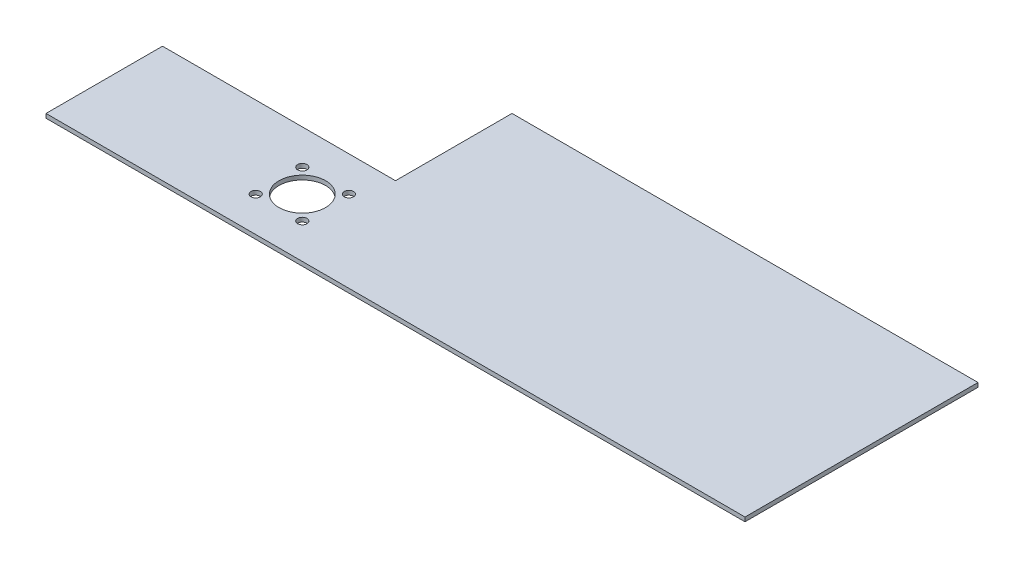
ISO-10303-21;
HEADER;
FILE_DESCRIPTION(('STEP AP214'),'2;1');
FILE_NAME('part.step','',(''),(''),'','','');
FILE_SCHEMA(('AUTOMOTIVE_DESIGN { 1 0 10303 214 1 1 1 1 }'));
ENDSEC;
DATA;
#1=APPLICATION_CONTEXT('core data for automotive mechanical design processes');
#2=APPLICATION_PROTOCOL_DEFINITION('international standard','automotive_design',2000,#1);
#3=PRODUCT_CONTEXT('',#1,'mechanical');
#4=PRODUCT('Part','Part','',(#3));
#5=PRODUCT_RELATED_PRODUCT_CATEGORY('part','',(#4));
#6=PRODUCT_DEFINITION_FORMATION('','',#4);
#7=PRODUCT_DEFINITION_CONTEXT('part definition',#1,'design');
#8=PRODUCT_DEFINITION('design','',#6,#7);
#9=PRODUCT_DEFINITION_SHAPE('','',#8);
#10=(LENGTH_UNIT() NAMED_UNIT(*) SI_UNIT(.MILLI.,.METRE.));
#11=(NAMED_UNIT(*) PLANE_ANGLE_UNIT() SI_UNIT($,.RADIAN.));
#12=(NAMED_UNIT(*) SI_UNIT($,.STERADIAN.) SOLID_ANGLE_UNIT());
#13=UNCERTAINTY_MEASURE_WITH_UNIT(LENGTH_MEASURE(1.E-05),#10,'distance_accuracy_value','');
#14=(GEOMETRIC_REPRESENTATION_CONTEXT(3) GLOBAL_UNCERTAINTY_ASSIGNED_CONTEXT((#13)) GLOBAL_UNIT_ASSIGNED_CONTEXT((#10,
#11,#12)) REPRESENTATION_CONTEXT('',''));
#15=CARTESIAN_POINT('',(0.,0.,0.));
#16=DIRECTION('',(0.,0.,1.));
#17=DIRECTION('',(1.,0.,0.));
#18=AXIS2_PLACEMENT_3D('',#15,#16,#17);
#19=CARTESIAN_POINT('',(0.,1.8,0.));
#20=DIRECTION('',(1.,0.,0.));
#21=DIRECTION('',(0.,0.,-1.));
#22=AXIS2_PLACEMENT_3D('',#19,#20,#21);
#23=PLANE('',#22);
#24=DIRECTION('',(0.,0.,1.));
#25=VECTOR('',#24,1.);
#26=CARTESIAN_POINT('',(0.,1.8,0.));
#27=LINE('',#26,#25);
#28=CARTESIAN_POINT('',(0.,1.8,-50.));
#29=VERTEX_POINT('',#28);
#30=CARTESIAN_POINT('',(0.,1.8,0.));
#31=VERTEX_POINT('',#30);
#32=EDGE_CURVE('E80',#29,#31,#27,.T.);
#33=ORIENTED_EDGE('',*,*,#32,.F.);
#34=DIRECTION('',(0.,1.,0.));
#35=VECTOR('',#34,1.);
#36=CARTESIAN_POINT('',(0.,0.,-50.));
#37=LINE('',#36,#35);
#38=CARTESIAN_POINT('',(0.,0.,-50.));
#39=VERTEX_POINT('',#38);
#40=EDGE_CURVE('E102',#39,#29,#37,.T.);
#41=ORIENTED_EDGE('',*,*,#40,.F.);
#42=DIRECTION('',(0.,0.,1.));
#43=VECTOR('',#42,1.);
#44=CARTESIAN_POINT('',(0.,0.,0.));
#45=LINE('',#44,#43);
#46=CARTESIAN_POINT('',(0.,0.,0.));
#47=VERTEX_POINT('',#46);
#48=EDGE_CURVE('E127',#39,#47,#45,.T.);
#49=ORIENTED_EDGE('',*,*,#48,.T.);
#50=DIRECTION('',(0.,-1.,0.));
#51=VECTOR('',#50,1.);
#52=CARTESIAN_POINT('',(0.,1.8,0.));
#53=LINE('',#52,#51);
#54=EDGE_CURVE('E11',#31,#47,#53,.T.);
#55=ORIENTED_EDGE('',*,*,#54,.F.);
#56=EDGE_LOOP('',(#33,#41,#49,#55));
#57=FACE_BOUND('',#56,.T.);
#58=ADVANCED_FACE('F35',(#57),#23,.F.);
#59=CARTESIAN_POINT('',(0.,1.8,0.));
#60=DIRECTION('',(0.,0.,-1.));
#61=DIRECTION('',(-1.,0.,0.));
#62=AXIS2_PLACEMENT_3D('',#59,#60,#61);
#63=PLANE('',#62);
#64=DIRECTION('',(1.,0.,0.));
#65=VECTOR('',#64,1.);
#66=CARTESIAN_POINT('',(0.,0.,0.));
#67=LINE('',#66,#65);
#68=CARTESIAN_POINT('',(300.,0.,0.));
#69=VERTEX_POINT('',#68);
#70=EDGE_CURVE('E118',#47,#69,#67,.T.);
#71=ORIENTED_EDGE('',*,*,#70,.T.);
#72=DIRECTION('',(0.,-1.,0.));
#73=VECTOR('',#72,1.);
#74=CARTESIAN_POINT('',(300.,1.8,0.));
#75=LINE('',#74,#73);
#76=CARTESIAN_POINT('',(300.,1.8,0.));
#77=VERTEX_POINT('',#76);
#78=EDGE_CURVE('E42',#77,#69,#75,.T.);
#79=ORIENTED_EDGE('',*,*,#78,.F.);
#80=DIRECTION('',(1.,0.,0.));
#81=VECTOR('',#80,1.);
#82=CARTESIAN_POINT('',(0.,1.8,0.));
#83=LINE('',#82,#81);
#84=EDGE_CURVE('E116',#31,#77,#83,.T.);
#85=ORIENTED_EDGE('',*,*,#84,.F.);
#86=ORIENTED_EDGE('',*,*,#54,.T.);
#87=EDGE_LOOP('',(#71,#79,#85,#86));
#88=FACE_BOUND('',#87,.T.);
#89=ADVANCED_FACE('F129',(#88),#63,.F.);
#90=CARTESIAN_POINT('',(300.,1.8,0.));
#91=DIRECTION('',(-1.,0.,0.));
#92=DIRECTION('',(0.,0.,1.));
#93=AXIS2_PLACEMENT_3D('',#90,#91,#92);
#94=PLANE('',#93);
#95=DIRECTION('',(0.,0.,-1.));
#96=VECTOR('',#95,1.);
#97=CARTESIAN_POINT('',(300.,0.,0.));
#98=LINE('',#97,#96);
#99=CARTESIAN_POINT('',(300.,0.,-100.));
#100=VERTEX_POINT('',#99);
#101=EDGE_CURVE('E75',#69,#100,#98,.T.);
#102=ORIENTED_EDGE('',*,*,#101,.T.);
#103=DIRECTION('',(0.,-1.,0.));
#104=VECTOR('',#103,1.);
#105=CARTESIAN_POINT('',(300.,1.8,-100.));
#106=LINE('',#105,#104);
#107=CARTESIAN_POINT('',(300.,1.8,-100.));
#108=VERTEX_POINT('',#107);
#109=EDGE_CURVE('E114',#108,#100,#106,.T.);
#110=ORIENTED_EDGE('',*,*,#109,.F.);
#111=DIRECTION('',(0.,0.,-1.));
#112=VECTOR('',#111,1.);
#113=CARTESIAN_POINT('',(300.,1.8,0.));
#114=LINE('',#113,#112);
#115=EDGE_CURVE('E58',#77,#108,#114,.T.);
#116=ORIENTED_EDGE('',*,*,#115,.F.);
#117=ORIENTED_EDGE('',*,*,#78,.T.);
#118=EDGE_LOOP('',(#102,#110,#116,#117));
#119=FACE_BOUND('',#118,.T.);
#120=ADVANCED_FACE('F124',(#119),#94,.F.);
#121=CARTESIAN_POINT('',(0.,1.8,-100.));
#122=DIRECTION('',(0.,0.,1.));
#123=DIRECTION('',(1.,0.,0.));
#124=AXIS2_PLACEMENT_3D('',#121,#122,#123);
#125=PLANE('',#124);
#126=DIRECTION('',(-1.,0.,0.));
#127=VECTOR('',#126,1.);
#128=CARTESIAN_POINT('',(0.,0.,-100.));
#129=LINE('',#128,#127);
#130=CARTESIAN_POINT('',(100.,0.,-100.));
#131=VERTEX_POINT('',#130);
#132=EDGE_CURVE('E109',#100,#131,#129,.T.);
#133=ORIENTED_EDGE('',*,*,#132,.T.);
#134=DIRECTION('',(0.,1.,0.));
#135=VECTOR('',#134,1.);
#136=CARTESIAN_POINT('',(100.,0.,-100.));
#137=LINE('',#136,#135);
#138=CARTESIAN_POINT('',(100.,1.8,-100.));
#139=VERTEX_POINT('',#138);
#140=EDGE_CURVE('E95',#131,#139,#137,.T.);
#141=ORIENTED_EDGE('',*,*,#140,.T.);
#142=DIRECTION('',(-1.,0.,0.));
#143=VECTOR('',#142,1.);
#144=CARTESIAN_POINT('',(0.,1.8,-100.));
#145=LINE('',#144,#143);
#146=EDGE_CURVE('E122',#108,#139,#145,.T.);
#147=ORIENTED_EDGE('',*,*,#146,.F.);
#148=ORIENTED_EDGE('',*,*,#109,.T.);
#149=EDGE_LOOP('',(#133,#141,#147,#148));
#150=FACE_BOUND('',#149,.T.);
#151=ADVANCED_FACE('F113',(#150),#125,.F.);
#152=CARTESIAN_POINT('',(0.,1.8,0.));
#153=DIRECTION('',(0.,-1.,0.));
#154=DIRECTION('',(0.,0.,-1.));
#155=AXIS2_PLACEMENT_3D('',#152,#153,#154);
#156=PLANE('',#155);
#157=CARTESIAN_POINT('',(85.,1.8,-25.));
#158=DIRECTION('',(0.,1.,0.));
#159=DIRECTION('',(0.,0.,1.));
#160=AXIS2_PLACEMENT_3D('',#157,#158,#159);
#161=CIRCLE('',#160,9.99999999999999);
#162=CARTESIAN_POINT('',(85.,1.8,-15.));
#163=VERTEX_POINT('',#162);
#164=EDGE_CURVE('E169',#163,#163,#161,.T.);
#165=ORIENTED_EDGE('',*,*,#164,.F.);
#166=EDGE_LOOP('',(#165));
#167=FACE_BOUND('',#166,.T.);
#168=CARTESIAN_POINT('',(95.,1.8,-15.));
#169=DIRECTION('',(0.,1.,0.));
#170=DIRECTION('',(0.,0.,1.));
#171=AXIS2_PLACEMENT_3D('',#168,#169,#170);
#172=CIRCLE('',#171,2.);
#173=CARTESIAN_POINT('',(95.,1.8,-13.));
#174=VERTEX_POINT('',#173);
#175=EDGE_CURVE('E163',#174,#174,#172,.T.);
#176=ORIENTED_EDGE('',*,*,#175,.F.);
#177=EDGE_LOOP('',(#176));
#178=FACE_BOUND('',#177,.T.);
#179=CARTESIAN_POINT('',(75.,1.8,-15.));
#180=DIRECTION('',(0.,1.,0.));
#181=DIRECTION('',(0.,0.,1.));
#182=AXIS2_PLACEMENT_3D('',#179,#180,#181);
#183=CIRCLE('',#182,2.);
#184=CARTESIAN_POINT('',(75.,1.8,-13.));
#185=VERTEX_POINT('',#184);
#186=EDGE_CURVE('E157',#185,#185,#183,.T.);
#187=ORIENTED_EDGE('',*,*,#186,.F.);
#188=EDGE_LOOP('',(#187));
#189=FACE_BOUND('',#188,.T.);
#190=CARTESIAN_POINT('',(75.,1.8,-35.));
#191=DIRECTION('',(0.,1.,0.));
#192=DIRECTION('',(0.,0.,1.));
#193=AXIS2_PLACEMENT_3D('',#190,#191,#192);
#194=CIRCLE('',#193,2.);
#195=CARTESIAN_POINT('',(75.,1.8,-33.));
#196=VERTEX_POINT('',#195);
#197=EDGE_CURVE('E151',#196,#196,#194,.T.);
#198=ORIENTED_EDGE('',*,*,#197,.F.);
#199=EDGE_LOOP('',(#198));
#200=FACE_BOUND('',#199,.T.);
#201=CARTESIAN_POINT('',(95.,1.8,-35.));
#202=DIRECTION('',(0.,1.,0.));
#203=DIRECTION('',(0.,0.,1.));
#204=AXIS2_PLACEMENT_3D('',#201,#202,#203);
#205=CIRCLE('',#204,2.);
#206=CARTESIAN_POINT('',(95.,1.8,-33.));
#207=VERTEX_POINT('',#206);
#208=EDGE_CURVE('E145',#207,#207,#205,.T.);
#209=ORIENTED_EDGE('',*,*,#208,.F.);
#210=EDGE_LOOP('',(#209));
#211=FACE_BOUND('',#210,.T.);
#212=ORIENTED_EDGE('',*,*,#146,.T.);
#213=DIRECTION('',(0.,0.,-1.));
#214=VECTOR('',#213,1.);
#215=CARTESIAN_POINT('',(100.,1.8,-50.));
#216=LINE('',#215,#214);
#217=CARTESIAN_POINT('',(100.,1.8,-50.));
#218=VERTEX_POINT('',#217);
#219=EDGE_CURVE('E98',#218,#139,#216,.T.);
#220=ORIENTED_EDGE('',*,*,#219,.F.);
#221=DIRECTION('',(1.,0.,0.));
#222=VECTOR('',#221,1.);
#223=CARTESIAN_POINT('',(100.,1.8,-50.));
#224=LINE('',#223,#222);
#225=EDGE_CURVE('E111',#29,#218,#224,.T.);
#226=ORIENTED_EDGE('',*,*,#225,.F.);
#227=ORIENTED_EDGE('',*,*,#32,.T.);
#228=ORIENTED_EDGE('',*,*,#84,.T.);
#229=ORIENTED_EDGE('',*,*,#115,.T.);
#230=EDGE_LOOP('',(#212,#220,#226,#227,#228,#229));
#231=FACE_BOUND('',#230,.T.);
#232=ADVANCED_FACE('F184',(#167,#178,#189,#200,#211,#231),#156,.F.);
#233=CARTESIAN_POINT('',(0.,0.,0.));
#234=DIRECTION('',(0.,-1.,0.));
#235=DIRECTION('',(0.,0.,-1.));
#236=AXIS2_PLACEMENT_3D('',#233,#234,#235);
#237=PLANE('',#236);
#238=CARTESIAN_POINT('',(85.,0.,-25.));
#239=DIRECTION('',(0.,1.,0.));
#240=DIRECTION('',(0.,0.,1.));
#241=AXIS2_PLACEMENT_3D('',#238,#239,#240);
#242=CIRCLE('',#241,9.99999999999999);
#243=CARTESIAN_POINT('',(85.,0.,-15.));
#244=VERTEX_POINT('',#243);
#245=EDGE_CURVE('E166',#244,#244,#242,.T.);
#246=ORIENTED_EDGE('',*,*,#245,.T.);
#247=EDGE_LOOP('',(#246));
#248=FACE_BOUND('',#247,.T.);
#249=CARTESIAN_POINT('',(95.,0.,-15.));
#250=DIRECTION('',(0.,1.,0.));
#251=DIRECTION('',(0.,0.,1.));
#252=AXIS2_PLACEMENT_3D('',#249,#250,#251);
#253=CIRCLE('',#252,2.);
#254=CARTESIAN_POINT('',(95.,0.,-13.));
#255=VERTEX_POINT('',#254);
#256=EDGE_CURVE('E160',#255,#255,#253,.T.);
#257=ORIENTED_EDGE('',*,*,#256,.T.);
#258=EDGE_LOOP('',(#257));
#259=FACE_BOUND('',#258,.T.);
#260=CARTESIAN_POINT('',(75.,0.,-15.));
#261=DIRECTION('',(0.,1.,0.));
#262=DIRECTION('',(0.,0.,1.));
#263=AXIS2_PLACEMENT_3D('',#260,#261,#262);
#264=CIRCLE('',#263,2.);
#265=CARTESIAN_POINT('',(75.,0.,-13.));
#266=VERTEX_POINT('',#265);
#267=EDGE_CURVE('E154',#266,#266,#264,.T.);
#268=ORIENTED_EDGE('',*,*,#267,.T.);
#269=EDGE_LOOP('',(#268));
#270=FACE_BOUND('',#269,.T.);
#271=CARTESIAN_POINT('',(75.,0.,-35.));
#272=DIRECTION('',(0.,1.,0.));
#273=DIRECTION('',(0.,0.,1.));
#274=AXIS2_PLACEMENT_3D('',#271,#272,#273);
#275=CIRCLE('',#274,2.);
#276=CARTESIAN_POINT('',(75.,0.,-33.));
#277=VERTEX_POINT('',#276);
#278=EDGE_CURVE('E148',#277,#277,#275,.T.);
#279=ORIENTED_EDGE('',*,*,#278,.T.);
#280=EDGE_LOOP('',(#279));
#281=FACE_BOUND('',#280,.T.);
#282=CARTESIAN_POINT('',(95.,0.,-35.));
#283=DIRECTION('',(0.,1.,0.));
#284=DIRECTION('',(0.,0.,1.));
#285=AXIS2_PLACEMENT_3D('',#282,#283,#284);
#286=CIRCLE('',#285,2.);
#287=CARTESIAN_POINT('',(95.,0.,-33.));
#288=VERTEX_POINT('',#287);
#289=EDGE_CURVE('E143',#288,#288,#286,.T.);
#290=ORIENTED_EDGE('',*,*,#289,.T.);
#291=EDGE_LOOP('',(#290));
#292=FACE_BOUND('',#291,.T.);
#293=DIRECTION('',(0.,0.,-1.));
#294=VECTOR('',#293,1.);
#295=CARTESIAN_POINT('',(100.,0.,-50.));
#296=LINE('',#295,#294);
#297=CARTESIAN_POINT('',(100.,0.,-50.));
#298=VERTEX_POINT('',#297);
#299=EDGE_CURVE('E49',#298,#131,#296,.T.);
#300=ORIENTED_EDGE('',*,*,#299,.T.);
#301=ORIENTED_EDGE('',*,*,#132,.F.);
#302=ORIENTED_EDGE('',*,*,#101,.F.);
#303=ORIENTED_EDGE('',*,*,#70,.F.);
#304=ORIENTED_EDGE('',*,*,#48,.F.);
#305=DIRECTION('',(1.,0.,0.));
#306=VECTOR('',#305,1.);
#307=CARTESIAN_POINT('',(100.,0.,-50.));
#308=LINE('',#307,#306);
#309=EDGE_CURVE('E103',#39,#298,#308,.T.);
#310=ORIENTED_EDGE('',*,*,#309,.T.);
#311=EDGE_LOOP('',(#300,#301,#302,#303,#304,#310));
#312=FACE_BOUND('',#311,.T.);
#313=ADVANCED_FACE('F108',(#248,#259,#270,#281,#292,#312),#237,.T.);
#314=CARTESIAN_POINT('',(100.,0.,-50.));
#315=DIRECTION('',(1.,0.,0.));
#316=DIRECTION('',(0.,0.,-1.));
#317=AXIS2_PLACEMENT_3D('',#314,#315,#316);
#318=PLANE('',#317);
#319=ORIENTED_EDGE('',*,*,#219,.T.);
#320=ORIENTED_EDGE('',*,*,#140,.F.);
#321=ORIENTED_EDGE('',*,*,#299,.F.);
#322=DIRECTION('',(0.,1.,0.));
#323=VECTOR('',#322,1.);
#324=CARTESIAN_POINT('',(100.,0.,-50.));
#325=LINE('',#324,#323);
#326=EDGE_CURVE('E132',#298,#218,#325,.T.);
#327=ORIENTED_EDGE('',*,*,#326,.T.);
#328=EDGE_LOOP('',(#319,#320,#321,#327));
#329=FACE_BOUND('',#328,.T.);
#330=ADVANCED_FACE('F96',(#329),#318,.F.);
#331=CARTESIAN_POINT('',(100.,0.,-50.));
#332=DIRECTION('',(0.,0.,1.));
#333=DIRECTION('',(1.,0.,0.));
#334=AXIS2_PLACEMENT_3D('',#331,#332,#333);
#335=PLANE('',#334);
#336=ORIENTED_EDGE('',*,*,#225,.T.);
#337=ORIENTED_EDGE('',*,*,#326,.F.);
#338=ORIENTED_EDGE('',*,*,#309,.F.);
#339=ORIENTED_EDGE('',*,*,#40,.T.);
#340=EDGE_LOOP('',(#336,#337,#338,#339));
#341=FACE_BOUND('',#340,.T.);
#342=ADVANCED_FACE('F196',(#341),#335,.F.);
#343=CARTESIAN_POINT('',(95.,0.,-35.));
#344=DIRECTION('',(0.,1.,0.));
#345=DIRECTION('',(0.,0.,1.));
#346=AXIS2_PLACEMENT_3D('',#343,#344,#345);
#347=CYLINDRICAL_SURFACE('',#346,2.);
#348=ORIENTED_EDGE('',*,*,#289,.F.);
#349=EDGE_LOOP('',(#348));
#350=FACE_BOUND('',#349,.T.);
#351=ORIENTED_EDGE('',*,*,#208,.T.);
#352=EDGE_LOOP('',(#351));
#353=FACE_BOUND('',#352,.T.);
#354=ADVANCED_FACE('F198',(#350,#353),#347,.F.);
#355=CARTESIAN_POINT('',(75.,0.,-35.));
#356=DIRECTION('',(0.,1.,0.));
#357=DIRECTION('',(0.,0.,1.));
#358=AXIS2_PLACEMENT_3D('',#355,#356,#357);
#359=CYLINDRICAL_SURFACE('',#358,2.);
#360=ORIENTED_EDGE('',*,*,#278,.F.);
#361=EDGE_LOOP('',(#360));
#362=FACE_BOUND('',#361,.T.);
#363=ORIENTED_EDGE('',*,*,#197,.T.);
#364=EDGE_LOOP('',(#363));
#365=FACE_BOUND('',#364,.T.);
#366=ADVANCED_FACE('F204',(#362,#365),#359,.F.);
#367=CARTESIAN_POINT('',(75.,0.,-15.));
#368=DIRECTION('',(0.,1.,0.));
#369=DIRECTION('',(0.,0.,1.));
#370=AXIS2_PLACEMENT_3D('',#367,#368,#369);
#371=CYLINDRICAL_SURFACE('',#370,2.);
#372=ORIENTED_EDGE('',*,*,#267,.F.);
#373=EDGE_LOOP('',(#372));
#374=FACE_BOUND('',#373,.T.);
#375=ORIENTED_EDGE('',*,*,#186,.T.);
#376=EDGE_LOOP('',(#375));
#377=FACE_BOUND('',#376,.T.);
#378=ADVANCED_FACE('F273',(#374,#377),#371,.F.);
#379=CARTESIAN_POINT('',(95.,0.,-15.));
#380=DIRECTION('',(0.,1.,0.));
#381=DIRECTION('',(0.,0.,1.));
#382=AXIS2_PLACEMENT_3D('',#379,#380,#381);
#383=CYLINDRICAL_SURFACE('',#382,2.);
#384=ORIENTED_EDGE('',*,*,#256,.F.);
#385=EDGE_LOOP('',(#384));
#386=FACE_BOUND('',#385,.T.);
#387=ORIENTED_EDGE('',*,*,#175,.T.);
#388=EDGE_LOOP('',(#387));
#389=FACE_BOUND('',#388,.T.);
#390=ADVANCED_FACE('F180',(#386,#389),#383,.F.);
#391=CARTESIAN_POINT('',(85.,0.,-25.));
#392=DIRECTION('',(0.,1.,0.));
#393=DIRECTION('',(0.,0.,1.));
#394=AXIS2_PLACEMENT_3D('',#391,#392,#393);
#395=CYLINDRICAL_SURFACE('',#394,9.99999999999999);
#396=ORIENTED_EDGE('',*,*,#245,.F.);
#397=EDGE_LOOP('',(#396));
#398=FACE_BOUND('',#397,.T.);
#399=ORIENTED_EDGE('',*,*,#164,.T.);
#400=EDGE_LOOP('',(#399));
#401=FACE_BOUND('',#400,.T.);
#402=ADVANCED_FACE('F177',(#398,#401),#395,.F.);
#403=CLOSED_SHELL('',(#58,#89,#120,#151,#232,#313,#330,#342,#354,#366,#378,#390,#402));
#404=MANIFOLD_SOLID_BREP('B2',#403);
#405=ADVANCED_BREP_SHAPE_REPRESENTATION('',(#18,#404),#14);
#406=SHAPE_DEFINITION_REPRESENTATION(#9,#405);
ENDSEC;
END-ISO-10303-21;
